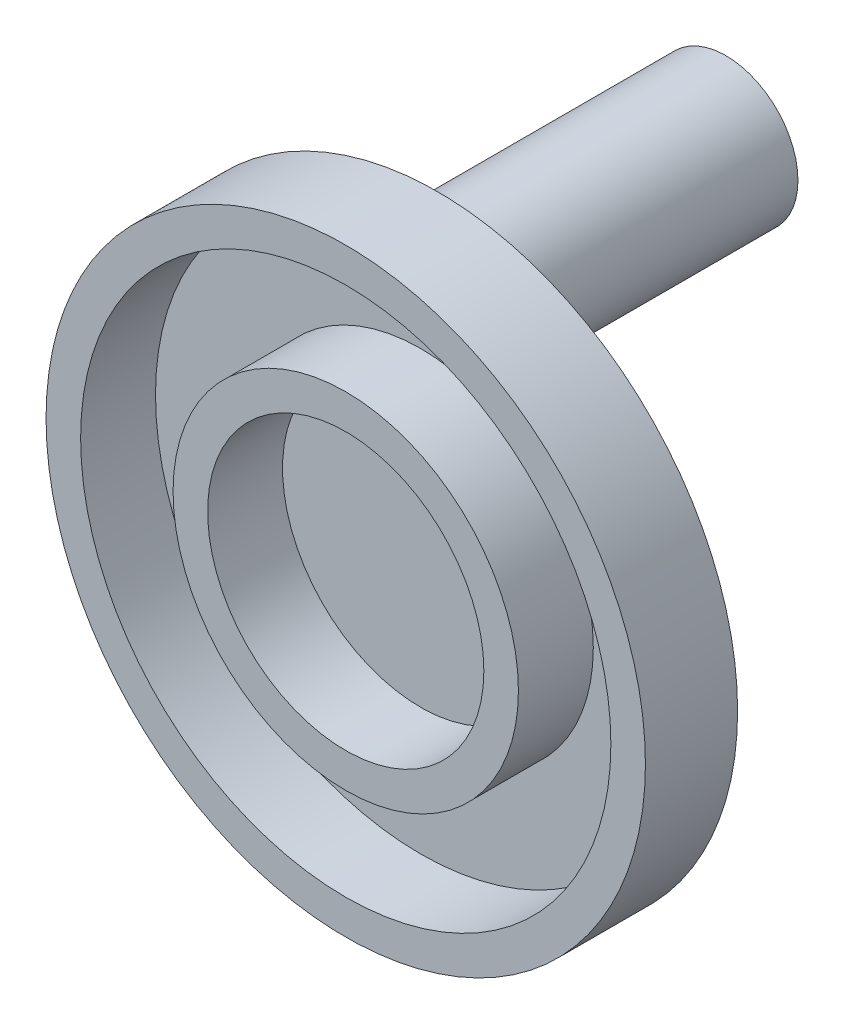
ISO-10303-21;
HEADER;
FILE_DESCRIPTION(('STEP AP214'),'2;1');
FILE_NAME('part.step','',(''),(''),'','','');
FILE_SCHEMA(('AUTOMOTIVE_DESIGN { 1 0 10303 214 1 1 1 1 }'));
ENDSEC;
DATA;
#1=APPLICATION_CONTEXT('core data for automotive mechanical design processes');
#2=APPLICATION_PROTOCOL_DEFINITION('international standard','automotive_design',2000,#1);
#3=PRODUCT_CONTEXT('',#1,'mechanical');
#4=PRODUCT('Part','Part','',(#3));
#5=PRODUCT_RELATED_PRODUCT_CATEGORY('part','',(#4));
#6=PRODUCT_DEFINITION_FORMATION('','',#4);
#7=PRODUCT_DEFINITION_CONTEXT('part definition',#1,'design');
#8=PRODUCT_DEFINITION('design','',#6,#7);
#9=PRODUCT_DEFINITION_SHAPE('','',#8);
#10=(LENGTH_UNIT() NAMED_UNIT(*) SI_UNIT(.MILLI.,.METRE.));
#11=(NAMED_UNIT(*) PLANE_ANGLE_UNIT() SI_UNIT($,.RADIAN.));
#12=(NAMED_UNIT(*) SI_UNIT($,.STERADIAN.) SOLID_ANGLE_UNIT());
#13=UNCERTAINTY_MEASURE_WITH_UNIT(LENGTH_MEASURE(1.E-05),#10,'distance_accuracy_value','');
#14=(GEOMETRIC_REPRESENTATION_CONTEXT(3) GLOBAL_UNCERTAINTY_ASSIGNED_CONTEXT((#13)) GLOBAL_UNIT_ASSIGNED_CONTEXT((#10,
#11,#12)) REPRESENTATION_CONTEXT('',''));
#15=CARTESIAN_POINT('',(0.,0.,0.));
#16=DIRECTION('',(0.,0.,1.));
#17=DIRECTION('',(1.,0.,0.));
#18=AXIS2_PLACEMENT_3D('',#15,#16,#17);
#19=CARTESIAN_POINT('',(0.,0.,-50.));
#20=DIRECTION('',(0.,0.,1.));
#21=DIRECTION('',(1.,0.,0.));
#22=AXIS2_PLACEMENT_3D('',#19,#20,#21);
#23=CYLINDRICAL_SURFACE('',#22,12.5);
#24=CARTESIAN_POINT('',(0.,0.,-50.));
#25=DIRECTION('',(0.,0.,1.));
#26=DIRECTION('',(1.,0.,0.));
#27=AXIS2_PLACEMENT_3D('',#24,#25,#26);
#28=CIRCLE('',#27,12.5);
#29=CARTESIAN_POINT('',(12.5,0.,-50.));
#30=VERTEX_POINT('',#29);
#31=EDGE_CURVE('E53',#30,#30,#28,.T.);
#32=ORIENTED_EDGE('',*,*,#31,.T.);
#33=EDGE_LOOP('',(#32));
#34=FACE_BOUND('',#33,.T.);
#35=CARTESIAN_POINT('',(0.,0.,0.));
#36=DIRECTION('',(0.,0.,1.));
#37=DIRECTION('',(1.,0.,0.));
#38=AXIS2_PLACEMENT_3D('',#35,#36,#37);
#39=CIRCLE('',#38,12.5);
#40=CARTESIAN_POINT('',(12.5,0.,0.));
#41=VERTEX_POINT('',#40);
#42=EDGE_CURVE('E69',#41,#41,#39,.T.);
#43=ORIENTED_EDGE('',*,*,#42,.F.);
#44=EDGE_LOOP('',(#43));
#45=FACE_BOUND('',#44,.T.);
#46=ADVANCED_FACE('F41',(#34,#45),#23,.T.);
#47=CARTESIAN_POINT('',(0.,0.,-50.));
#48=DIRECTION('',(0.,0.,1.));
#49=DIRECTION('',(1.,0.,0.));
#50=AXIS2_PLACEMENT_3D('',#47,#48,#49);
#51=PLANE('',#50);
#52=ORIENTED_EDGE('',*,*,#31,.F.);
#53=EDGE_LOOP('',(#52));
#54=FACE_BOUND('',#53,.T.);
#55=ADVANCED_FACE('F79',(#54),#51,.F.);
#56=CARTESIAN_POINT('',(0.,0.,0.));
#57=DIRECTION('',(0.,0.,1.));
#58=DIRECTION('',(1.,0.,0.));
#59=AXIS2_PLACEMENT_3D('',#56,#57,#58);
#60=PLANE('',#59);
#61=CARTESIAN_POINT('',(0.,-35.,0.));
#62=DIRECTION('',(0.,0.,1.));
#63=DIRECTION('',(1.,0.,0.));
#64=AXIS2_PLACEMENT_3D('',#61,#62,#63);
#65=CIRCLE('',#64,52.025);
#66=CARTESIAN_POINT('',(52.025,-35.,0.));
#67=VERTEX_POINT('',#66);
#68=EDGE_CURVE('E62',#67,#67,#65,.T.);
#69=ORIENTED_EDGE('',*,*,#68,.F.);
#70=EDGE_LOOP('',(#69));
#71=FACE_BOUND('',#70,.T.);
#72=ORIENTED_EDGE('',*,*,#42,.T.);
#73=EDGE_LOOP('',(#72));
#74=FACE_BOUND('',#73,.T.);
#75=ADVANCED_FACE('F76',(#71,#74),#60,.F.);
#76=CARTESIAN_POINT('',(0.,-35.,16.));
#77=DIRECTION('',(0.,0.,-1.));
#78=DIRECTION('',(-1.,0.,0.));
#79=AXIS2_PLACEMENT_3D('',#76,#77,#78);
#80=CYLINDRICAL_SURFACE('',#79,46.025);
#81=CARTESIAN_POINT('',(0.,-35.,3.));
#82=DIRECTION('',(0.,0.,1.));
#83=DIRECTION('',(1.,0.,0.));
#84=AXIS2_PLACEMENT_3D('',#81,#82,#83);
#85=CIRCLE('',#84,46.025);
#86=CARTESIAN_POINT('',(46.025,-35.,3.));
#87=VERTEX_POINT('',#86);
#88=EDGE_CURVE('E11',#87,#87,#85,.T.);
#89=ORIENTED_EDGE('',*,*,#88,.F.);
#90=EDGE_LOOP('',(#89));
#91=FACE_BOUND('',#90,.T.);
#92=CARTESIAN_POINT('',(0.,-35.,16.));
#93=DIRECTION('',(0.,0.,1.));
#94=DIRECTION('',(1.,0.,0.));
#95=AXIS2_PLACEMENT_3D('',#92,#93,#94);
#96=CIRCLE('',#95,46.025);
#97=CARTESIAN_POINT('',(46.025,-35.,16.));
#98=VERTEX_POINT('',#97);
#99=EDGE_CURVE('E63',#98,#98,#96,.T.);
#100=ORIENTED_EDGE('',*,*,#99,.T.);
#101=EDGE_LOOP('',(#100));
#102=FACE_BOUND('',#101,.T.);
#103=ADVANCED_FACE('F89',(#91,#102),#80,.F.);
#104=CARTESIAN_POINT('',(0.,-35.,16.));
#105=DIRECTION('',(0.,0.,-1.));
#106=DIRECTION('',(-1.,0.,0.));
#107=AXIS2_PLACEMENT_3D('',#104,#105,#106);
#108=CYLINDRICAL_SURFACE('',#107,52.025);
#109=CARTESIAN_POINT('',(0.,-35.,16.));
#110=DIRECTION('',(0.,0.,1.));
#111=DIRECTION('',(1.,0.,0.));
#112=AXIS2_PLACEMENT_3D('',#109,#110,#111);
#113=CIRCLE('',#112,52.025);
#114=CARTESIAN_POINT('',(52.025,-35.,16.));
#115=VERTEX_POINT('',#114);
#116=EDGE_CURVE('E66',#115,#115,#113,.T.);
#117=ORIENTED_EDGE('',*,*,#116,.F.);
#118=EDGE_LOOP('',(#117));
#119=FACE_BOUND('',#118,.T.);
#120=ORIENTED_EDGE('',*,*,#68,.T.);
#121=EDGE_LOOP('',(#120));
#122=FACE_BOUND('',#121,.T.);
#123=ADVANCED_FACE('F95',(#119,#122),#108,.T.);
#124=CARTESIAN_POINT('',(0.,0.,16.));
#125=DIRECTION('',(0.,0.,1.));
#126=DIRECTION('',(1.,0.,0.));
#127=AXIS2_PLACEMENT_3D('',#124,#125,#126);
#128=PLANE('',#127);
#129=ORIENTED_EDGE('',*,*,#99,.F.);
#130=EDGE_LOOP('',(#129));
#131=FACE_BOUND('',#130,.T.);
#132=ORIENTED_EDGE('',*,*,#116,.T.);
#133=EDGE_LOOP('',(#132));
#134=FACE_BOUND('',#133,.T.);
#135=ADVANCED_FACE('F98',(#131,#134),#128,.T.);
#136=CARTESIAN_POINT('',(0.,-35.,3.));
#137=DIRECTION('',(0.,0.,1.));
#138=DIRECTION('',(1.,0.,0.));
#139=AXIS2_PLACEMENT_3D('',#136,#137,#138);
#140=PLANE('',#139);
#141=CARTESIAN_POINT('',(0.,-35.,3.));
#142=DIRECTION('',(0.,0.,1.));
#143=DIRECTION('',(1.,0.,0.));
#144=AXIS2_PLACEMENT_3D('',#141,#142,#143);
#145=CIRCLE('',#144,29.975);
#146=CARTESIAN_POINT('',(29.975,-35.,3.));
#147=VERTEX_POINT('',#146);
#148=EDGE_CURVE('E44',#147,#147,#145,.T.);
#149=ORIENTED_EDGE('',*,*,#148,.F.);
#150=EDGE_LOOP('',(#149));
#151=FACE_BOUND('',#150,.T.);
#152=ORIENTED_EDGE('',*,*,#88,.T.);
#153=EDGE_LOOP('',(#152));
#154=FACE_BOUND('',#153,.T.);
#155=ADVANCED_FACE('F103',(#151,#154),#140,.T.);
#156=CARTESIAN_POINT('',(0.,-35.,16.));
#157=DIRECTION('',(0.,0.,-1.));
#158=DIRECTION('',(-1.,0.,0.));
#159=AXIS2_PLACEMENT_3D('',#156,#157,#158);
#160=CYLINDRICAL_SURFACE('',#159,23.975);
#161=CARTESIAN_POINT('',(0.,-35.,3.));
#162=DIRECTION('',(0.,0.,1.));
#163=DIRECTION('',(1.,0.,0.));
#164=AXIS2_PLACEMENT_3D('',#161,#162,#163);
#165=CIRCLE('',#164,23.975);
#166=CARTESIAN_POINT('',(23.975,-35.,3.));
#167=VERTEX_POINT('',#166);
#168=EDGE_CURVE('E48',#167,#167,#165,.T.);
#169=ORIENTED_EDGE('',*,*,#168,.F.);
#170=EDGE_LOOP('',(#169));
#171=FACE_BOUND('',#170,.T.);
#172=CARTESIAN_POINT('',(0.,-35.,16.));
#173=DIRECTION('',(0.,0.,1.));
#174=DIRECTION('',(1.,0.,0.));
#175=AXIS2_PLACEMENT_3D('',#172,#173,#174);
#176=CIRCLE('',#175,23.975);
#177=CARTESIAN_POINT('',(23.975,-35.,16.));
#178=VERTEX_POINT('',#177);
#179=EDGE_CURVE('E56',#178,#178,#176,.T.);
#180=ORIENTED_EDGE('',*,*,#179,.T.);
#181=EDGE_LOOP('',(#180));
#182=FACE_BOUND('',#181,.T.);
#183=ADVANCED_FACE('F105',(#171,#182),#160,.F.);
#184=CARTESIAN_POINT('',(0.,0.,16.));
#185=DIRECTION('',(0.,0.,1.));
#186=DIRECTION('',(1.,0.,0.));
#187=AXIS2_PLACEMENT_3D('',#184,#185,#186);
#188=PLANE('',#187);
#189=ORIENTED_EDGE('',*,*,#179,.F.);
#190=EDGE_LOOP('',(#189));
#191=FACE_BOUND('',#190,.T.);
#192=CARTESIAN_POINT('',(0.,-35.,16.));
#193=DIRECTION('',(0.,0.,1.));
#194=DIRECTION('',(1.,0.,0.));
#195=AXIS2_PLACEMENT_3D('',#192,#193,#194);
#196=CIRCLE('',#195,29.975);
#197=CARTESIAN_POINT('',(29.975,-35.,16.));
#198=VERTEX_POINT('',#197);
#199=EDGE_CURVE('E59',#198,#198,#196,.T.);
#200=ORIENTED_EDGE('',*,*,#199,.T.);
#201=EDGE_LOOP('',(#200));
#202=FACE_BOUND('',#201,.T.);
#203=ADVANCED_FACE('F108',(#191,#202),#188,.T.);
#204=CARTESIAN_POINT('',(0.,-35.,16.));
#205=DIRECTION('',(0.,0.,-1.));
#206=DIRECTION('',(-1.,0.,0.));
#207=AXIS2_PLACEMENT_3D('',#204,#205,#206);
#208=CYLINDRICAL_SURFACE('',#207,29.975);
#209=ORIENTED_EDGE('',*,*,#148,.T.);
#210=EDGE_LOOP('',(#209));
#211=FACE_BOUND('',#210,.T.);
#212=ORIENTED_EDGE('',*,*,#199,.F.);
#213=EDGE_LOOP('',(#212));
#214=FACE_BOUND('',#213,.T.);
#215=ADVANCED_FACE('F110',(#211,#214),#208,.T.);
#216=ORIENTED_EDGE('',*,*,#168,.T.);
#217=EDGE_LOOP('',(#216));
#218=FACE_BOUND('',#217,.T.);
#219=ADVANCED_FACE('F113',(#218),#140,.T.);
#220=CLOSED_SHELL('',(#46,#55,#75,#103,#123,#135,#155,#183,#203,#215,#219));
#221=MANIFOLD_SOLID_BREP('B2',#220);
#222=ADVANCED_BREP_SHAPE_REPRESENTATION('',(#18,#221),#14);
#223=SHAPE_DEFINITION_REPRESENTATION(#9,#222);
ENDSEC;
END-ISO-10303-21;
